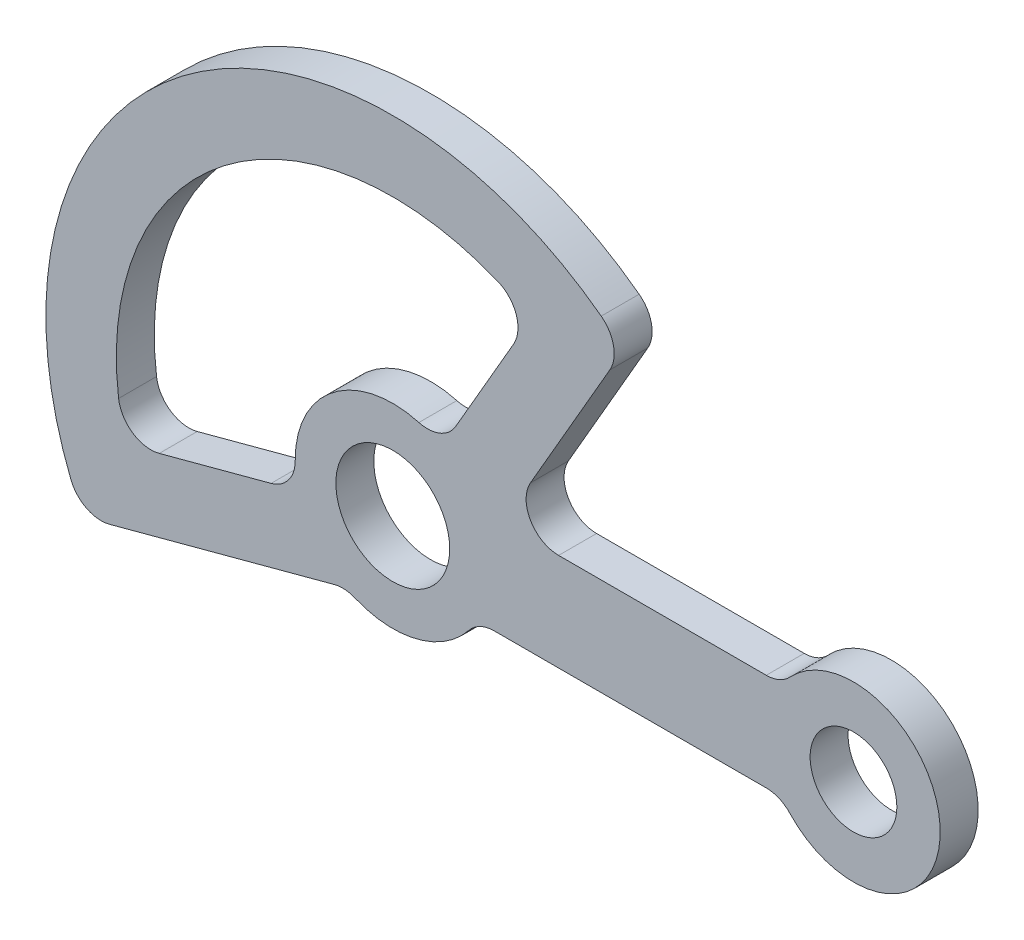
ISO-10303-21;
HEADER;
FILE_DESCRIPTION(('STEP AP214'),'2;1');
FILE_NAME('part.step','',(''),(''),'','','');
FILE_SCHEMA(('AUTOMOTIVE_DESIGN { 1 0 10303 214 1 1 1 1 }'));
ENDSEC;
DATA;
#1=APPLICATION_CONTEXT('core data for automotive mechanical design processes');
#2=APPLICATION_PROTOCOL_DEFINITION('international standard','automotive_design',2000,#1);
#3=PRODUCT_CONTEXT('',#1,'mechanical');
#4=PRODUCT('Part','Part','',(#3));
#5=PRODUCT_RELATED_PRODUCT_CATEGORY('part','',(#4));
#6=PRODUCT_DEFINITION_FORMATION('','',#4);
#7=PRODUCT_DEFINITION_CONTEXT('part definition',#1,'design');
#8=PRODUCT_DEFINITION('design','',#6,#7);
#9=PRODUCT_DEFINITION_SHAPE('','',#8);
#10=(LENGTH_UNIT() NAMED_UNIT(*) SI_UNIT(.MILLI.,.METRE.));
#11=(NAMED_UNIT(*) PLANE_ANGLE_UNIT() SI_UNIT($,.RADIAN.));
#12=(NAMED_UNIT(*) SI_UNIT($,.STERADIAN.) SOLID_ANGLE_UNIT());
#13=UNCERTAINTY_MEASURE_WITH_UNIT(LENGTH_MEASURE(1.E-05),#10,'distance_accuracy_value','');
#14=(GEOMETRIC_REPRESENTATION_CONTEXT(3) GLOBAL_UNCERTAINTY_ASSIGNED_CONTEXT((#13)) GLOBAL_UNIT_ASSIGNED_CONTEXT((#10,
#11,#12)) REPRESENTATION_CONTEXT('',''));
#15=CARTESIAN_POINT('',(0.,0.,0.));
#16=DIRECTION('',(0.,0.,1.));
#17=DIRECTION('',(1.,0.,0.));
#18=AXIS2_PLACEMENT_3D('',#15,#16,#17);
#19=CARTESIAN_POINT('',(85.,0.,7.));
#20=DIRECTION('',(0.,0.,1.));
#21=DIRECTION('',(1.,0.,0.));
#22=AXIS2_PLACEMENT_3D('',#19,#20,#21);
#23=PLANE('',#22);
#24=CARTESIAN_POINT('',(0.,0.,7.));
#25=DIRECTION('',(0.,0.,1.));
#26=DIRECTION('',(1.,0.,0.));
#27=AXIS2_PLACEMENT_3D('',#24,#25,#26);
#28=CIRCLE('',#27,10.5);
#29=CARTESIAN_POINT('',(10.5,0.,7.));
#30=VERTEX_POINT('',#29);
#31=EDGE_CURVE('E227',#30,#30,#28,.T.);
#32=ORIENTED_EDGE('',*,*,#31,.F.);
#33=EDGE_LOOP('',(#32));
#34=FACE_BOUND('',#33,.T.);
#35=CARTESIAN_POINT('',(0.,0.,7.));
#36=DIRECTION('',(0.,0.,1.));
#37=DIRECTION('',(1.,0.,0.));
#38=AXIS2_PLACEMENT_3D('',#35,#36,#37);
#39=CIRCLE('',#38,64.);
#40=CARTESIAN_POINT('',(38.4553888744394,51.1584114932788,7.));
#41=VERTEX_POINT('',#40);
#42=CARTESIAN_POINT('',(-59.3682179208102,-23.9042820621576,7.));
#43=VERTEX_POINT('',#42);
#44=EDGE_CURVE('E445',#41,#43,#39,.T.);
#45=ORIENTED_EDGE('',*,*,#44,.T.);
#46=CARTESIAN_POINT('',(-53.8024474907343,-21.6632556188303,7.));
#47=DIRECTION('',(0.,0.,1.));
#48=DIRECTION('',(1.,0.,0.));
#49=AXIS2_PLACEMENT_3D('',#46,#47,#48);
#50=CIRCLE('',#49,6.);
#51=CARTESIAN_POINT('',(-52.2495332201192,-27.4588105765648,7.));
#52=VERTEX_POINT('',#51);
#53=EDGE_CURVE('E296',#43,#52,#50,.T.);
#54=ORIENTED_EDGE('',*,*,#53,.T.);
#55=DIRECTION('',(0.96592582628907,0.258819045102515,0.));
#56=VECTOR('',#55,1.);
#57=CARTESIAN_POINT('',(-57.16584787117,-28.7761331170511,7.));
#58=LINE('',#57,#56);
#59=CARTESIAN_POINT('',(-10.7986052500332,-16.3520679014599,7.));
#60=VERTEX_POINT('',#59);
#61=EDGE_CURVE('E449',#52,#60,#58,.T.);
#62=ORIENTED_EDGE('',*,*,#61,.T.);
#63=CARTESIAN_POINT('',(-9.24569097941816,-22.1476228591943,7.));
#64=DIRECTION('',(0.,0.,1.));
#65=DIRECTION('',(1.,0.,0.));
#66=AXIS2_PLACEMENT_3D('',#63,#64,#65);
#67=CIRCLE('',#66,6.);
#68=CARTESIAN_POINT('',(-6.93426823456362,-16.6107171443957,7.));
#69=VERTEX_POINT('',#68);
#70=EDGE_CURVE('E323',#60,#69,#67,.F.);
#71=ORIENTED_EDGE('',*,*,#70,.T.);
#72=CARTESIAN_POINT('',(0.,0.,7.));
#73=DIRECTION('',(0.,0.,1.));
#74=DIRECTION('',(1.,0.,0.));
#75=AXIS2_PLACEMENT_3D('',#72,#73,#74);
#76=CIRCLE('',#75,18.);
#77=CARTESIAN_POINT('',(14.0512454963964,-11.25,7.));
#78=VERTEX_POINT('',#77);
#79=EDGE_CURVE('E452',#69,#78,#76,.T.);
#80=ORIENTED_EDGE('',*,*,#79,.T.);
#81=CARTESIAN_POINT('',(18.7349939951952,-15.,7.));
#82=DIRECTION('',(0.,0.,1.));
#83=DIRECTION('',(1.,0.,0.));
#84=AXIS2_PLACEMENT_3D('',#81,#82,#83);
#85=CIRCLE('',#84,6.);
#86=CARTESIAN_POINT('',(18.7349939951952,-8.99999999999999,7.));
#87=VERTEX_POINT('',#86);
#88=EDGE_CURVE('E317',#78,#87,#85,.F.);
#89=ORIENTED_EDGE('',*,*,#88,.T.);
#90=DIRECTION('',(1.,0.,0.));
#91=VECTOR('',#90,1.);
#92=CARTESIAN_POINT('',(71.7712434446771,-9.,7.));
#93=LINE('',#92,#91);
#94=CARTESIAN_POINT('',(68.9065230605689,-9.,7.));
#95=VERTEX_POINT('',#94);
#96=EDGE_CURVE('E238',#87,#95,#93,.T.);
#97=ORIENTED_EDGE('',*,*,#96,.T.);
#98=CARTESIAN_POINT('',(68.9065230605689,-15.,7.));
#99=DIRECTION('',(0.,0.,1.));
#100=DIRECTION('',(1.,0.,0.));
#101=AXIS2_PLACEMENT_3D('',#98,#99,#100);
#102=CIRCLE('',#101,6.);
#103=CARTESIAN_POINT('',(73.2956531349592,-10.9090909090909,7.));
#104=VERTEX_POINT('',#103);
#105=EDGE_CURVE('E205',#95,#104,#102,.F.);
#106=ORIENTED_EDGE('',*,*,#105,.T.);
#107=CARTESIAN_POINT('',(85.,0.,7.));
#108=DIRECTION('',(0.,0.,1.));
#109=DIRECTION('',(1.,0.,0.));
#110=AXIS2_PLACEMENT_3D('',#107,#108,#109);
#111=CIRCLE('',#110,16.);
#112=CARTESIAN_POINT('',(73.2956531349592,10.9090909090909,7.));
#113=VERTEX_POINT('',#112);
#114=EDGE_CURVE('E215',#104,#113,#111,.T.);
#115=ORIENTED_EDGE('',*,*,#114,.T.);
#116=CARTESIAN_POINT('',(68.9065230605689,15.,7.));
#117=DIRECTION('',(0.,0.,1.));
#118=DIRECTION('',(1.,0.,0.));
#119=AXIS2_PLACEMENT_3D('',#116,#117,#118);
#120=CIRCLE('',#119,6.);
#121=CARTESIAN_POINT('',(68.9065230605689,9.,7.));
#122=VERTEX_POINT('',#121);
#123=EDGE_CURVE('E328',#113,#122,#120,.F.);
#124=ORIENTED_EDGE('',*,*,#123,.T.);
#125=DIRECTION('',(-1.,0.,0.));
#126=VECTOR('',#125,1.);
#127=CARTESIAN_POINT('',(71.7712434446771,9.,7.));
#128=LINE('',#127,#126);
#129=CARTESIAN_POINT('',(30.5995642670502,8.99999999999999,7.));
#130=VERTEX_POINT('',#129);
#131=EDGE_CURVE('E437',#122,#130,#128,.T.);
#132=ORIENTED_EDGE('',*,*,#131,.T.);
#133=CARTESIAN_POINT('',(30.5995642670502,15.,7.));
#134=DIRECTION('',(0.,0.,1.));
#135=DIRECTION('',(1.,0.,0.));
#136=AXIS2_PLACEMENT_3D('',#133,#134,#135);
#137=CIRCLE('',#136,6.);
#138=CARTESIAN_POINT('',(25.4034118443436,18.,7.));
#139=VERTEX_POINT('',#138);
#140=EDGE_CURVE('E334',#130,#139,#137,.F.);
#141=ORIENTED_EDGE('',*,*,#140,.T.);
#142=DIRECTION('',(0.500000000000001,0.866025403784438,0.));
#143=VECTOR('',#142,1.);
#144=CARTESIAN_POINT('',(42.5912203169844,47.7701575453766,7.));
#145=LINE('',#144,#143);
#146=CARTESIAN_POINT('',(40.0463485901673,43.3623104157839,7.));
#147=VERTEX_POINT('',#146);
#148=EDGE_CURVE('E441',#139,#147,#145,.T.);
#149=ORIENTED_EDGE('',*,*,#148,.T.);
#150=CARTESIAN_POINT('',(34.8501961674607,46.3623104157839,7.));
#151=DIRECTION('',(0.,0.,1.));
#152=DIRECTION('',(1.,0.,0.));
#153=AXIS2_PLACEMENT_3D('',#150,#151,#152);
#154=CIRCLE('',#153,6.);
#155=EDGE_CURVE('E293',#147,#41,#154,.T.);
#156=ORIENTED_EDGE('',*,*,#155,.T.);
#157=EDGE_LOOP('',(#45,#54,#62,#71,#80,#89,#97,#106,#115,#124,#132,#141,#149,#156));
#158=FACE_BOUND('',#157,.T.);
#159=CARTESIAN_POINT('',(85.,0.,7.));
#160=DIRECTION('',(0.,0.,1.));
#161=DIRECTION('',(1.,0.,0.));
#162=AXIS2_PLACEMENT_3D('',#159,#160,#161);
#163=CIRCLE('',#162,8.00000000000001);
#164=CARTESIAN_POINT('',(93.,0.,7.));
#165=VERTEX_POINT('',#164);
#166=EDGE_CURVE('E425',#165,#165,#163,.T.);
#167=ORIENTED_EDGE('',*,*,#166,.F.);
#168=EDGE_LOOP('',(#167));
#169=FACE_BOUND('',#168,.T.);
#170=DIRECTION('',(0.96592582628907,0.258819045102515,0.));
#171=VECTOR('',#170,1.);
#172=CARTESIAN_POINT('',(-17.3866648732033,-4.65874281184526,7.));
#173=LINE('',#172,#171);
#174=CARTESIAN_POINT('',(-43.0785592152712,-11.5428651528279,7.));
#175=VERTEX_POINT('',#174);
#176=CARTESIAN_POINT('',(-22.4460878333352,-6.01441110818007,7.));
#177=VERTEX_POINT('',#176);
#178=EDGE_CURVE('E399',#175,#177,#173,.T.);
#179=ORIENTED_EDGE('',*,*,#178,.F.);
#180=CARTESIAN_POINT('',(-44.6314734858863,-5.74731019509351,7.));
#181=DIRECTION('',(0.,0.,1.));
#182=DIRECTION('',(1.,0.,0.));
#183=AXIS2_PLACEMENT_3D('',#180,#181,#182);
#184=CIRCLE('',#183,6.);
#185=CARTESIAN_POINT('',(-50.5823366173378,-6.51361822110598,7.));
#186=VERTEX_POINT('',#185);
#187=EDGE_CURVE('E11',#175,#186,#184,.F.);
#188=ORIENTED_EDGE('',*,*,#187,.T.);
#189=CARTESIAN_POINT('',(0.,0.,7.));
#190=DIRECTION('',(0.,0.,1.));
#191=DIRECTION('',(1.,0.,0.));
#192=AXIS2_PLACEMENT_3D('',#189,#190,#191);
#193=CIRCLE('',#192,51.);
#194=CARTESIAN_POINT('',(19.3833441247073,47.1729368445847,7.));
#195=VERTEX_POINT('',#194);
#196=EDGE_CURVE('E397',#195,#186,#193,.T.);
#197=ORIENTED_EDGE('',*,*,#196,.F.);
#198=CARTESIAN_POINT('',(17.1029506982712,41.6231795687512,7.));
#199=DIRECTION('',(0.,0.,1.));
#200=DIRECTION('',(1.,0.,0.));
#201=AXIS2_PLACEMENT_3D('',#198,#199,#200);
#202=CIRCLE('',#201,6.);
#203=CARTESIAN_POINT('',(22.2991031209778,38.6231795687512,7.));
#204=VERTEX_POINT('',#203);
#205=EDGE_CURVE('E373',#195,#204,#202,.F.);
#206=ORIENTED_EDGE('',*,*,#205,.T.);
#207=DIRECTION('',(0.500000000000001,0.866025403784438,0.));
#208=VECTOR('',#207,1.);
#209=CARTESIAN_POINT('',(9.00000000000003,15.5884572681199,7.));
#210=LINE('',#209,#208);
#211=CARTESIAN_POINT('',(11.6189500386223,20.1246117974981,7.));
#212=VERTEX_POINT('',#211);
#213=EDGE_CURVE('E415',#212,#204,#210,.T.);
#214=ORIENTED_EDGE('',*,*,#213,.F.);
#215=CARTESIAN_POINT('',(6.42279761591566,23.1246117974981,7.));
#216=DIRECTION('',(0.,0.,1.));
#217=DIRECTION('',(1.,0.,0.));
#218=AXIS2_PLACEMENT_3D('',#215,#216,#217);
#219=CIRCLE('',#218,6.);
#220=CARTESIAN_POINT('',(4.81709821193674,17.3434588481236,7.));
#221=VERTEX_POINT('',#220);
#222=EDGE_CURVE('E367',#212,#221,#219,.F.);
#223=ORIENTED_EDGE('',*,*,#222,.T.);
#224=CARTESIAN_POINT('',(0.,0.,7.));
#225=DIRECTION('',(0.,0.,-1.));
#226=DIRECTION('',(1.,0.,0.));
#227=AXIS2_PLACEMENT_3D('',#224,#225,#226);
#228=CIRCLE('',#227,18.);
#229=CARTESIAN_POINT('',(-17.9992515779627,-0.164142112834241,7.));
#230=VERTEX_POINT('',#229);
#231=EDGE_CURVE('E408',#230,#221,#228,.T.);
#232=ORIENTED_EDGE('',*,*,#231,.F.);
#233=CARTESIAN_POINT('',(-23.9990021039503,-0.218856150445655,7.));
#234=DIRECTION('',(0.,0.,1.));
#235=DIRECTION('',(1.,0.,0.));
#236=AXIS2_PLACEMENT_3D('',#233,#234,#235);
#237=CIRCLE('',#236,6.);
#238=EDGE_CURVE('E59',#230,#177,#237,.F.);
#239=ORIENTED_EDGE('',*,*,#238,.T.);
#240=EDGE_LOOP('',(#179,#188,#197,#206,#214,#223,#232,#239));
#241=FACE_BOUND('',#240,.T.);
#242=ADVANCED_FACE('F43',(#34,#158,#169,#241),#23,.T.);
#243=CARTESIAN_POINT('',(85.,0.,0.));
#244=DIRECTION('',(0.,0.,1.));
#245=DIRECTION('',(1.,0.,0.));
#246=AXIS2_PLACEMENT_3D('',#243,#244,#245);
#247=PLANE('',#246);
#248=CARTESIAN_POINT('',(85.,0.,0.));
#249=DIRECTION('',(0.,0.,1.));
#250=DIRECTION('',(1.,0.,0.));
#251=AXIS2_PLACEMENT_3D('',#248,#249,#250);
#252=CIRCLE('',#251,8.00000000000001);
#253=CARTESIAN_POINT('',(93.,0.,0.));
#254=VERTEX_POINT('',#253);
#255=EDGE_CURVE('E419',#254,#254,#252,.T.);
#256=ORIENTED_EDGE('',*,*,#255,.T.);
#257=EDGE_LOOP('',(#256));
#258=FACE_BOUND('',#257,.T.);
#259=CARTESIAN_POINT('',(0.,0.,0.));
#260=DIRECTION('',(0.,0.,1.));
#261=DIRECTION('',(1.,0.,0.));
#262=AXIS2_PLACEMENT_3D('',#259,#260,#261);
#263=CIRCLE('',#262,10.5);
#264=CARTESIAN_POINT('',(10.5,0.,0.));
#265=VERTEX_POINT('',#264);
#266=EDGE_CURVE('E235',#265,#265,#263,.T.);
#267=ORIENTED_EDGE('',*,*,#266,.T.);
#268=EDGE_LOOP('',(#267));
#269=FACE_BOUND('',#268,.T.);
#270=DIRECTION('',(0.96592582628907,0.258819045102515,0.));
#271=VECTOR('',#270,1.);
#272=CARTESIAN_POINT('',(-57.16584787117,-28.7761331170511,0.));
#273=LINE('',#272,#271);
#274=CARTESIAN_POINT('',(-52.2495332201192,-27.4588105765648,0.));
#275=VERTEX_POINT('',#274);
#276=CARTESIAN_POINT('',(-10.7986052500332,-16.3520679014599,0.));
#277=VERTEX_POINT('',#276);
#278=EDGE_CURVE('E248',#275,#277,#273,.T.);
#279=ORIENTED_EDGE('',*,*,#278,.F.);
#280=CARTESIAN_POINT('',(-53.8024474907343,-21.6632556188303,0.));
#281=DIRECTION('',(0.,0.,1.));
#282=DIRECTION('',(1.,0.,0.));
#283=AXIS2_PLACEMENT_3D('',#280,#281,#282);
#284=CIRCLE('',#283,6.);
#285=CARTESIAN_POINT('',(-59.3682179208102,-23.9042820621576,0.));
#286=VERTEX_POINT('',#285);
#287=EDGE_CURVE('E283',#275,#286,#284,.F.);
#288=ORIENTED_EDGE('',*,*,#287,.T.);
#289=CARTESIAN_POINT('',(0.,0.,0.));
#290=DIRECTION('',(0.,0.,1.));
#291=DIRECTION('',(1.,0.,0.));
#292=AXIS2_PLACEMENT_3D('',#289,#290,#291);
#293=CIRCLE('',#292,64.);
#294=CARTESIAN_POINT('',(38.4553888744394,51.1584114932788,0.));
#295=VERTEX_POINT('',#294);
#296=EDGE_CURVE('E244',#295,#286,#293,.T.);
#297=ORIENTED_EDGE('',*,*,#296,.F.);
#298=CARTESIAN_POINT('',(34.8501961674607,46.3623104157839,0.));
#299=DIRECTION('',(0.,0.,1.));
#300=DIRECTION('',(1.,0.,0.));
#301=AXIS2_PLACEMENT_3D('',#298,#299,#300);
#302=CIRCLE('',#301,6.);
#303=CARTESIAN_POINT('',(40.0463485901673,43.3623104157839,0.));
#304=VERTEX_POINT('',#303);
#305=EDGE_CURVE('E280',#295,#304,#302,.F.);
#306=ORIENTED_EDGE('',*,*,#305,.T.);
#307=DIRECTION('',(0.500000000000001,0.866025403784438,0.));
#308=VECTOR('',#307,1.);
#309=CARTESIAN_POINT('',(42.5912203169844,47.7701575453766,0.));
#310=LINE('',#309,#308);
#311=CARTESIAN_POINT('',(25.4034118443436,18.,0.));
#312=VERTEX_POINT('',#311);
#313=EDGE_CURVE('E232',#312,#304,#310,.T.);
#314=ORIENTED_EDGE('',*,*,#313,.F.);
#315=CARTESIAN_POINT('',(30.5995642670502,15.,0.));
#316=DIRECTION('',(0.,0.,1.));
#317=DIRECTION('',(1.,0.,0.));
#318=AXIS2_PLACEMENT_3D('',#315,#316,#317);
#319=CIRCLE('',#318,6.);
#320=CARTESIAN_POINT('',(30.5995642670502,8.99999999999999,0.));
#321=VERTEX_POINT('',#320);
#322=EDGE_CURVE('E331',#312,#321,#319,.T.);
#323=ORIENTED_EDGE('',*,*,#322,.T.);
#324=DIRECTION('',(-1.,0.,0.));
#325=VECTOR('',#324,1.);
#326=CARTESIAN_POINT('',(71.7712434446771,9.,0.));
#327=LINE('',#326,#325);
#328=CARTESIAN_POINT('',(68.9065230605689,9.,0.));
#329=VERTEX_POINT('',#328);
#330=EDGE_CURVE('E226',#329,#321,#327,.T.);
#331=ORIENTED_EDGE('',*,*,#330,.F.);
#332=CARTESIAN_POINT('',(68.9065230605689,15.,0.));
#333=DIRECTION('',(0.,0.,1.));
#334=DIRECTION('',(1.,0.,0.));
#335=AXIS2_PLACEMENT_3D('',#332,#333,#334);
#336=CIRCLE('',#335,6.);
#337=CARTESIAN_POINT('',(73.2956531349592,10.9090909090909,0.));
#338=VERTEX_POINT('',#337);
#339=EDGE_CURVE('E224',#329,#338,#336,.T.);
#340=ORIENTED_EDGE('',*,*,#339,.T.);
#341=CARTESIAN_POINT('',(85.,0.,0.));
#342=DIRECTION('',(0.,0.,1.));
#343=DIRECTION('',(1.,0.,0.));
#344=AXIS2_PLACEMENT_3D('',#341,#342,#343);
#345=CIRCLE('',#344,16.);
#346=CARTESIAN_POINT('',(73.2956531349592,-10.9090909090909,0.));
#347=VERTEX_POINT('',#346);
#348=EDGE_CURVE('E212',#347,#338,#345,.T.);
#349=ORIENTED_EDGE('',*,*,#348,.F.);
#350=CARTESIAN_POINT('',(68.9065230605689,-15.,0.));
#351=DIRECTION('',(0.,0.,1.));
#352=DIRECTION('',(1.,0.,0.));
#353=AXIS2_PLACEMENT_3D('',#350,#351,#352);
#354=CIRCLE('',#353,6.);
#355=CARTESIAN_POINT('',(68.9065230605689,-9.,0.));
#356=VERTEX_POINT('',#355);
#357=EDGE_CURVE('E194',#347,#356,#354,.T.);
#358=ORIENTED_EDGE('',*,*,#357,.T.);
#359=DIRECTION('',(1.,0.,0.));
#360=VECTOR('',#359,1.);
#361=CARTESIAN_POINT('',(71.7712434446771,-9.,0.));
#362=LINE('',#361,#360);
#363=CARTESIAN_POINT('',(18.7349939951952,-8.99999999999999,0.));
#364=VERTEX_POINT('',#363);
#365=EDGE_CURVE('E256',#364,#356,#362,.T.);
#366=ORIENTED_EDGE('',*,*,#365,.F.);
#367=CARTESIAN_POINT('',(18.7349939951952,-15.,0.));
#368=DIRECTION('',(0.,0.,1.));
#369=DIRECTION('',(1.,0.,0.));
#370=AXIS2_PLACEMENT_3D('',#367,#368,#369);
#371=CIRCLE('',#370,6.);
#372=CARTESIAN_POINT('',(14.0512454963964,-11.25,0.));
#373=VERTEX_POINT('',#372);
#374=EDGE_CURVE('E314',#364,#373,#371,.T.);
#375=ORIENTED_EDGE('',*,*,#374,.T.);
#376=CARTESIAN_POINT('',(0.,0.,0.));
#377=DIRECTION('',(0.,0.,1.));
#378=DIRECTION('',(1.,0.,0.));
#379=AXIS2_PLACEMENT_3D('',#376,#377,#378);
#380=CIRCLE('',#379,18.);
#381=CARTESIAN_POINT('',(-6.93426823456362,-16.6107171443957,0.));
#382=VERTEX_POINT('',#381);
#383=EDGE_CURVE('E252',#382,#373,#380,.T.);
#384=ORIENTED_EDGE('',*,*,#383,.F.);
#385=CARTESIAN_POINT('',(-9.24569097941816,-22.1476228591943,0.));
#386=DIRECTION('',(0.,0.,1.));
#387=DIRECTION('',(1.,0.,0.));
#388=AXIS2_PLACEMENT_3D('',#385,#386,#387);
#389=CIRCLE('',#388,6.);
#390=EDGE_CURVE('E320',#382,#277,#389,.T.);
#391=ORIENTED_EDGE('',*,*,#390,.T.);
#392=EDGE_LOOP('',(#279,#288,#297,#306,#314,#323,#331,#340,#349,#358,#366,#375,#384,#391));
#393=FACE_BOUND('',#392,.T.);
#394=DIRECTION('',(0.500000000000001,0.866025403784438,0.));
#395=VECTOR('',#394,1.);
#396=CARTESIAN_POINT('',(9.00000000000003,15.5884572681199,0.));
#397=LINE('',#396,#395);
#398=CARTESIAN_POINT('',(11.6189500386223,20.1246117974981,0.));
#399=VERTEX_POINT('',#398);
#400=CARTESIAN_POINT('',(22.2991031209778,38.6231795687512,0.));
#401=VERTEX_POINT('',#400);
#402=EDGE_CURVE('E404',#399,#401,#397,.T.);
#403=ORIENTED_EDGE('',*,*,#402,.T.);
#404=CARTESIAN_POINT('',(17.1029506982712,41.6231795687512,0.));
#405=DIRECTION('',(0.,0.,1.));
#406=DIRECTION('',(1.,0.,0.));
#407=AXIS2_PLACEMENT_3D('',#404,#405,#406);
#408=CIRCLE('',#407,6.);
#409=CARTESIAN_POINT('',(19.3833441247073,47.1729368445847,0.));
#410=VERTEX_POINT('',#409);
#411=EDGE_CURVE('E370',#401,#410,#408,.T.);
#412=ORIENTED_EDGE('',*,*,#411,.T.);
#413=CARTESIAN_POINT('',(0.,0.,0.));
#414=DIRECTION('',(0.,0.,1.));
#415=DIRECTION('',(1.,0.,0.));
#416=AXIS2_PLACEMENT_3D('',#413,#414,#415);
#417=CIRCLE('',#416,51.);
#418=CARTESIAN_POINT('',(-50.5823366173378,-6.51361822110598,0.));
#419=VERTEX_POINT('',#418);
#420=EDGE_CURVE('E386',#410,#419,#417,.T.);
#421=ORIENTED_EDGE('',*,*,#420,.T.);
#422=CARTESIAN_POINT('',(-44.6314734858863,-5.74731019509351,0.));
#423=DIRECTION('',(0.,0.,1.));
#424=DIRECTION('',(1.,0.,0.));
#425=AXIS2_PLACEMENT_3D('',#422,#423,#424);
#426=CIRCLE('',#425,6.);
#427=CARTESIAN_POINT('',(-43.0785592152712,-11.5428651528279,0.));
#428=VERTEX_POINT('',#427);
#429=EDGE_CURVE('E52',#419,#428,#426,.T.);
#430=ORIENTED_EDGE('',*,*,#429,.T.);
#431=DIRECTION('',(0.96592582628907,0.258819045102515,0.));
#432=VECTOR('',#431,1.);
#433=CARTESIAN_POINT('',(-17.3866648732033,-4.65874281184526,0.));
#434=LINE('',#433,#432);
#435=CARTESIAN_POINT('',(-22.4460878333352,-6.01441110818007,0.));
#436=VERTEX_POINT('',#435);
#437=EDGE_CURVE('E384',#428,#436,#434,.T.);
#438=ORIENTED_EDGE('',*,*,#437,.T.);
#439=CARTESIAN_POINT('',(-23.9990021039503,-0.218856150445655,0.));
#440=DIRECTION('',(0.,0.,1.));
#441=DIRECTION('',(1.,0.,0.));
#442=AXIS2_PLACEMENT_3D('',#439,#440,#441);
#443=CIRCLE('',#442,6.);
#444=CARTESIAN_POINT('',(-17.9992515779627,-0.164142112834241,0.));
#445=VERTEX_POINT('',#444);
#446=EDGE_CURVE('E376',#436,#445,#443,.T.);
#447=ORIENTED_EDGE('',*,*,#446,.T.);
#448=CARTESIAN_POINT('',(0.,0.,0.));
#449=DIRECTION('',(0.,0.,-1.));
#450=DIRECTION('',(1.,0.,0.));
#451=AXIS2_PLACEMENT_3D('',#448,#449,#450);
#452=CIRCLE('',#451,18.);
#453=CARTESIAN_POINT('',(4.81709821193674,17.3434588481236,0.));
#454=VERTEX_POINT('',#453);
#455=EDGE_CURVE('E392',#445,#454,#452,.T.);
#456=ORIENTED_EDGE('',*,*,#455,.T.);
#457=CARTESIAN_POINT('',(6.42279761591566,23.1246117974981,0.));
#458=DIRECTION('',(0.,0.,1.));
#459=DIRECTION('',(1.,0.,0.));
#460=AXIS2_PLACEMENT_3D('',#457,#458,#459);
#461=CIRCLE('',#460,6.);
#462=EDGE_CURVE('E364',#454,#399,#461,.T.);
#463=ORIENTED_EDGE('',*,*,#462,.T.);
#464=EDGE_LOOP('',(#403,#412,#421,#430,#438,#447,#456,#463));
#465=FACE_BOUND('',#464,.T.);
#466=ADVANCED_FACE('F221',(#258,#269,#393,#465),#247,.F.);
#467=CARTESIAN_POINT('',(85.,0.,7.));
#468=DIRECTION('',(0.,0.,-1.));
#469=DIRECTION('',(-1.,0.,0.));
#470=AXIS2_PLACEMENT_3D('',#467,#468,#469);
#471=CYLINDRICAL_SURFACE('',#470,16.);
#472=ORIENTED_EDGE('',*,*,#114,.F.);
#473=DIRECTION('',(0.,0.,-1.));
#474=VECTOR('',#473,1.);
#475=CARTESIAN_POINT('',(73.2956531349592,-10.9090909090909,7.));
#476=LINE('',#475,#474);
#477=EDGE_CURVE('E198',#104,#347,#476,.T.);
#478=ORIENTED_EDGE('',*,*,#477,.T.);
#479=ORIENTED_EDGE('',*,*,#348,.T.);
#480=DIRECTION('',(0.,0.,-1.));
#481=VECTOR('',#480,1.);
#482=CARTESIAN_POINT('',(73.2956531349592,10.9090909090909,7.));
#483=LINE('',#482,#481);
#484=EDGE_CURVE('E218',#338,#113,#483,.F.);
#485=ORIENTED_EDGE('',*,*,#484,.T.);
#486=EDGE_LOOP('',(#472,#478,#479,#485));
#487=FACE_BOUND('',#486,.T.);
#488=ADVANCED_FACE('F211',(#487),#471,.T.);
#489=CARTESIAN_POINT('',(71.7712434446771,9.,7.));
#490=DIRECTION('',(0.,-1.,0.));
#491=DIRECTION('',(1.,0.,0.));
#492=AXIS2_PLACEMENT_3D('',#489,#490,#491);
#493=PLANE('',#492);
#494=ORIENTED_EDGE('',*,*,#131,.F.);
#495=DIRECTION('',(0.,0.,1.));
#496=VECTOR('',#495,1.);
#497=CARTESIAN_POINT('',(68.9065230605689,9.,0.));
#498=LINE('',#497,#496);
#499=EDGE_CURVE('E302',#122,#329,#498,.F.);
#500=ORIENTED_EDGE('',*,*,#499,.T.);
#501=ORIENTED_EDGE('',*,*,#330,.T.);
#502=DIRECTION('',(0.,0.,-1.));
#503=VECTOR('',#502,1.);
#504=CARTESIAN_POINT('',(30.5995642670502,8.99999999999999,7.));
#505=LINE('',#504,#503);
#506=EDGE_CURVE('E299',#321,#130,#505,.F.);
#507=ORIENTED_EDGE('',*,*,#506,.T.);
#508=EDGE_LOOP('',(#494,#500,#501,#507));
#509=FACE_BOUND('',#508,.T.);
#510=ADVANCED_FACE('F504',(#509),#493,.F.);
#511=CARTESIAN_POINT('',(42.5912203169844,47.7701575453766,7.));
#512=DIRECTION('',(-0.866025403784438,0.500000000000001,0.));
#513=DIRECTION('',(-0.500000000000001,-0.866025403784438,0.));
#514=AXIS2_PLACEMENT_3D('',#511,#512,#513);
#515=PLANE('',#514);
#516=ORIENTED_EDGE('',*,*,#313,.T.);
#517=DIRECTION('',(0.,0.,-1.));
#518=VECTOR('',#517,1.);
#519=CARTESIAN_POINT('',(40.0463485901673,43.3623104157839,7.));
#520=LINE('',#519,#518);
#521=EDGE_CURVE('E206',#304,#147,#520,.F.);
#522=ORIENTED_EDGE('',*,*,#521,.T.);
#523=ORIENTED_EDGE('',*,*,#148,.F.);
#524=DIRECTION('',(0.,0.,-1.));
#525=VECTOR('',#524,1.);
#526=CARTESIAN_POINT('',(25.4034118443436,18.,0.));
#527=LINE('',#526,#525);
#528=EDGE_CURVE('E306',#139,#312,#527,.T.);
#529=ORIENTED_EDGE('',*,*,#528,.T.);
#530=EDGE_LOOP('',(#516,#522,#523,#529));
#531=FACE_BOUND('',#530,.T.);
#532=ADVANCED_FACE('F495',(#531),#515,.F.);
#533=CARTESIAN_POINT('',(0.,0.,7.));
#534=DIRECTION('',(0.,0.,-1.));
#535=DIRECTION('',(-1.,0.,0.));
#536=AXIS2_PLACEMENT_3D('',#533,#534,#535);
#537=CYLINDRICAL_SURFACE('',#536,64.);
#538=ORIENTED_EDGE('',*,*,#296,.T.);
#539=DIRECTION('',(0.,0.,-1.));
#540=VECTOR('',#539,1.);
#541=CARTESIAN_POINT('',(-59.3682179208102,-23.9042820621576,7.));
#542=LINE('',#541,#540);
#543=EDGE_CURVE('E290',#286,#43,#542,.F.);
#544=ORIENTED_EDGE('',*,*,#543,.T.);
#545=ORIENTED_EDGE('',*,*,#44,.F.);
#546=DIRECTION('',(0.,0.,-1.));
#547=VECTOR('',#546,1.);
#548=CARTESIAN_POINT('',(38.4553888744394,51.1584114932788,7.));
#549=LINE('',#548,#547);
#550=EDGE_CURVE('E286',#41,#295,#549,.T.);
#551=ORIENTED_EDGE('',*,*,#550,.T.);
#552=EDGE_LOOP('',(#538,#544,#545,#551));
#553=FACE_BOUND('',#552,.T.);
#554=ADVANCED_FACE('F486',(#553),#537,.T.);
#555=CARTESIAN_POINT('',(-57.16584787117,-28.7761331170511,7.));
#556=DIRECTION('',(-0.258819045102515,0.96592582628907,0.));
#557=DIRECTION('',(-0.96592582628907,-0.258819045102515,0.));
#558=AXIS2_PLACEMENT_3D('',#555,#556,#557);
#559=PLANE('',#558);
#560=ORIENTED_EDGE('',*,*,#278,.T.);
#561=DIRECTION('',(0.,0.,1.));
#562=VECTOR('',#561,1.);
#563=CARTESIAN_POINT('',(-10.7986052500333,-16.3520679014599,7.));
#564=LINE('',#563,#562);
#565=EDGE_CURVE('E277',#277,#60,#564,.T.);
#566=ORIENTED_EDGE('',*,*,#565,.T.);
#567=ORIENTED_EDGE('',*,*,#61,.F.);
#568=DIRECTION('',(0.,0.,-1.));
#569=VECTOR('',#568,1.);
#570=CARTESIAN_POINT('',(-52.2495332201192,-27.4588105765648,7.));
#571=LINE('',#570,#569);
#572=EDGE_CURVE('E273',#52,#275,#571,.T.);
#573=ORIENTED_EDGE('',*,*,#572,.T.);
#574=EDGE_LOOP('',(#560,#566,#567,#573));
#575=FACE_BOUND('',#574,.T.);
#576=ADVANCED_FACE('F477',(#575),#559,.F.);
#577=CARTESIAN_POINT('',(0.,0.,7.));
#578=DIRECTION('',(0.,0.,-1.));
#579=DIRECTION('',(-1.,0.,0.));
#580=AXIS2_PLACEMENT_3D('',#577,#578,#579);
#581=CYLINDRICAL_SURFACE('',#580,18.);
#582=ORIENTED_EDGE('',*,*,#383,.T.);
#583=DIRECTION('',(0.,0.,-1.));
#584=VECTOR('',#583,1.);
#585=CARTESIAN_POINT('',(14.0512454963964,-11.25,7.));
#586=LINE('',#585,#584);
#587=EDGE_CURVE('E270',#373,#78,#586,.F.);
#588=ORIENTED_EDGE('',*,*,#587,.T.);
#589=ORIENTED_EDGE('',*,*,#79,.F.);
#590=DIRECTION('',(0.,0.,-1.));
#591=VECTOR('',#590,1.);
#592=CARTESIAN_POINT('',(-6.93426823456362,-16.6107171443957,7.));
#593=LINE('',#592,#591);
#594=EDGE_CURVE('E266',#69,#382,#593,.T.);
#595=ORIENTED_EDGE('',*,*,#594,.T.);
#596=EDGE_LOOP('',(#582,#588,#589,#595));
#597=FACE_BOUND('',#596,.T.);
#598=ADVANCED_FACE('F470',(#597),#581,.T.);
#599=CARTESIAN_POINT('',(71.7712434446771,-9.,7.));
#600=DIRECTION('',(0.,1.,0.));
#601=DIRECTION('',(-1.,0.,0.));
#602=AXIS2_PLACEMENT_3D('',#599,#600,#601);
#603=PLANE('',#602);
#604=ORIENTED_EDGE('',*,*,#365,.T.);
#605=DIRECTION('',(0.,0.,1.));
#606=VECTOR('',#605,1.);
#607=CARTESIAN_POINT('',(68.9065230605689,-9.,7.));
#608=LINE('',#607,#606);
#609=EDGE_CURVE('E199',#356,#95,#608,.T.);
#610=ORIENTED_EDGE('',*,*,#609,.T.);
#611=ORIENTED_EDGE('',*,*,#96,.F.);
#612=DIRECTION('',(0.,0.,1.));
#613=VECTOR('',#612,1.);
#614=CARTESIAN_POINT('',(18.7349939951952,-8.99999999999999,0.));
#615=LINE('',#614,#613);
#616=EDGE_CURVE('E217',#87,#364,#615,.F.);
#617=ORIENTED_EDGE('',*,*,#616,.T.);
#618=EDGE_LOOP('',(#604,#610,#611,#617));
#619=FACE_BOUND('',#618,.T.);
#620=ADVANCED_FACE('F464',(#619),#603,.F.);
#621=CARTESIAN_POINT('',(0.,0.,7.));
#622=DIRECTION('',(0.,0.,-1.));
#623=DIRECTION('',(-1.,0.,0.));
#624=AXIS2_PLACEMENT_3D('',#621,#622,#623);
#625=CYLINDRICAL_SURFACE('',#624,10.5);
#626=ORIENTED_EDGE('',*,*,#31,.T.);
#627=EDGE_LOOP('',(#626));
#628=FACE_BOUND('',#627,.T.);
#629=ORIENTED_EDGE('',*,*,#266,.F.);
#630=EDGE_LOOP('',(#629));
#631=FACE_BOUND('',#630,.T.);
#632=ADVANCED_FACE('F527',(#628,#631),#625,.F.);
#633=CARTESIAN_POINT('',(85.,0.,7.));
#634=DIRECTION('',(0.,0.,-1.));
#635=DIRECTION('',(-1.,0.,0.));
#636=AXIS2_PLACEMENT_3D('',#633,#634,#635);
#637=CYLINDRICAL_SURFACE('',#636,8.00000000000001);
#638=ORIENTED_EDGE('',*,*,#166,.T.);
#639=EDGE_LOOP('',(#638));
#640=FACE_BOUND('',#639,.T.);
#641=ORIENTED_EDGE('',*,*,#255,.F.);
#642=EDGE_LOOP('',(#641));
#643=FACE_BOUND('',#642,.T.);
#644=ADVANCED_FACE('F605',(#640,#643),#637,.F.);
#645=CARTESIAN_POINT('',(0.,0.,7.));
#646=DIRECTION('',(0.,0.,-1.));
#647=DIRECTION('',(-1.,0.,0.));
#648=AXIS2_PLACEMENT_3D('',#645,#646,#647);
#649=CYLINDRICAL_SURFACE('',#648,51.);
#650=ORIENTED_EDGE('',*,*,#420,.F.);
#651=DIRECTION('',(0.,0.,-1.));
#652=VECTOR('',#651,1.);
#653=CARTESIAN_POINT('',(19.3833441247073,47.1729368445847,7.));
#654=LINE('',#653,#652);
#655=EDGE_CURVE('E355',#410,#195,#654,.F.);
#656=ORIENTED_EDGE('',*,*,#655,.T.);
#657=ORIENTED_EDGE('',*,*,#196,.T.);
#658=DIRECTION('',(0.,0.,-1.));
#659=VECTOR('',#658,1.);
#660=CARTESIAN_POINT('',(-50.5823366173378,-6.51361822110598,7.));
#661=LINE('',#660,#659);
#662=EDGE_CURVE('E351',#186,#419,#661,.T.);
#663=ORIENTED_EDGE('',*,*,#662,.T.);
#664=EDGE_LOOP('',(#650,#656,#657,#663));
#665=FACE_BOUND('',#664,.T.);
#666=ADVANCED_FACE('F401',(#665),#649,.F.);
#667=CARTESIAN_POINT('',(-17.3866648732033,-4.65874281184526,7.));
#668=DIRECTION('',(-0.258819045102515,0.96592582628907,0.));
#669=DIRECTION('',(-0.96592582628907,-0.258819045102515,0.));
#670=AXIS2_PLACEMENT_3D('',#667,#668,#669);
#671=PLANE('',#670);
#672=ORIENTED_EDGE('',*,*,#178,.T.);
#673=DIRECTION('',(0.,0.,1.));
#674=VECTOR('',#673,1.);
#675=CARTESIAN_POINT('',(-22.4460878333352,-6.01441110818007,0.));
#676=LINE('',#675,#674);
#677=EDGE_CURVE('E360',#177,#436,#676,.F.);
#678=ORIENTED_EDGE('',*,*,#677,.T.);
#679=ORIENTED_EDGE('',*,*,#437,.F.);
#680=DIRECTION('',(0.,0.,1.));
#681=VECTOR('',#680,1.);
#682=CARTESIAN_POINT('',(-43.0785592152712,-11.5428651528279,7.));
#683=LINE('',#682,#681);
#684=EDGE_CURVE('E66',#428,#175,#683,.T.);
#685=ORIENTED_EDGE('',*,*,#684,.T.);
#686=EDGE_LOOP('',(#672,#678,#679,#685));
#687=FACE_BOUND('',#686,.T.);
#688=ADVANCED_FACE('F389',(#687),#671,.T.);
#689=CARTESIAN_POINT('',(0.,0.,7.));
#690=DIRECTION('',(0.,0.,-1.));
#691=DIRECTION('',(-1.,0.,0.));
#692=AXIS2_PLACEMENT_3D('',#689,#690,#691);
#693=CYLINDRICAL_SURFACE('',#692,18.);
#694=ORIENTED_EDGE('',*,*,#231,.T.);
#695=DIRECTION('',(0.,0.,-1.));
#696=VECTOR('',#695,1.);
#697=CARTESIAN_POINT('',(4.81709821193674,17.3434588481236,7.));
#698=LINE('',#697,#696);
#699=EDGE_CURVE('E340',#221,#454,#698,.T.);
#700=ORIENTED_EDGE('',*,*,#699,.T.);
#701=ORIENTED_EDGE('',*,*,#455,.F.);
#702=DIRECTION('',(0.,0.,-1.));
#703=VECTOR('',#702,1.);
#704=CARTESIAN_POINT('',(-17.9992515779627,-0.164142112834241,7.));
#705=LINE('',#704,#703);
#706=EDGE_CURVE('E337',#445,#230,#705,.F.);
#707=ORIENTED_EDGE('',*,*,#706,.T.);
#708=EDGE_LOOP('',(#694,#700,#701,#707));
#709=FACE_BOUND('',#708,.T.);
#710=ADVANCED_FACE('F617',(#709),#693,.T.);
#711=CARTESIAN_POINT('',(9.00000000000003,15.5884572681199,7.));
#712=DIRECTION('',(-0.866025403784438,0.500000000000001,0.));
#713=DIRECTION('',(-0.500000000000001,-0.866025403784438,0.));
#714=AXIS2_PLACEMENT_3D('',#711,#712,#713);
#715=PLANE('',#714);
#716=ORIENTED_EDGE('',*,*,#402,.F.);
#717=DIRECTION('',(0.,0.,1.));
#718=VECTOR('',#717,1.);
#719=CARTESIAN_POINT('',(11.6189500386223,20.1246117974981,7.));
#720=LINE('',#719,#718);
#721=EDGE_CURVE('E348',#399,#212,#720,.T.);
#722=ORIENTED_EDGE('',*,*,#721,.T.);
#723=ORIENTED_EDGE('',*,*,#213,.T.);
#724=DIRECTION('',(0.,0.,1.));
#725=VECTOR('',#724,1.);
#726=CARTESIAN_POINT('',(22.2991031209778,38.6231795687512,0.));
#727=LINE('',#726,#725);
#728=EDGE_CURVE('E344',#204,#401,#727,.F.);
#729=ORIENTED_EDGE('',*,*,#728,.T.);
#730=EDGE_LOOP('',(#716,#722,#723,#729));
#731=FACE_BOUND('',#730,.T.);
#732=ADVANCED_FACE('F546',(#731),#715,.T.);
#733=CARTESIAN_POINT('',(68.9065230605689,-15.,7.));
#734=DIRECTION('',(0.,0.,-1.));
#735=DIRECTION('',(-1.,0.,0.));
#736=AXIS2_PLACEMENT_3D('',#733,#734,#735);
#737=CYLINDRICAL_SURFACE('',#736,6.);
#738=ORIENTED_EDGE('',*,*,#105,.F.);
#739=ORIENTED_EDGE('',*,*,#609,.F.);
#740=ORIENTED_EDGE('',*,*,#357,.F.);
#741=ORIENTED_EDGE('',*,*,#477,.F.);
#742=EDGE_LOOP('',(#738,#739,#740,#741));
#743=FACE_BOUND('',#742,.T.);
#744=ADVANCED_FACE('F197',(#743),#737,.F.);
#745=CARTESIAN_POINT('',(18.7349939951952,-15.,7.));
#746=DIRECTION('',(0.,0.,-1.));
#747=DIRECTION('',(-1.,0.,0.));
#748=AXIS2_PLACEMENT_3D('',#745,#746,#747);
#749=CYLINDRICAL_SURFACE('',#748,6.);
#750=ORIENTED_EDGE('',*,*,#88,.F.);
#751=ORIENTED_EDGE('',*,*,#587,.F.);
#752=ORIENTED_EDGE('',*,*,#374,.F.);
#753=ORIENTED_EDGE('',*,*,#616,.F.);
#754=EDGE_LOOP('',(#750,#751,#752,#753));
#755=FACE_BOUND('',#754,.T.);
#756=ADVANCED_FACE('F466',(#755),#749,.F.);
#757=CARTESIAN_POINT('',(-9.24569097941816,-22.1476228591943,7.));
#758=DIRECTION('',(0.,0.,-1.));
#759=DIRECTION('',(-1.,0.,0.));
#760=AXIS2_PLACEMENT_3D('',#757,#758,#759);
#761=CYLINDRICAL_SURFACE('',#760,6.);
#762=ORIENTED_EDGE('',*,*,#70,.F.);
#763=ORIENTED_EDGE('',*,*,#565,.F.);
#764=ORIENTED_EDGE('',*,*,#390,.F.);
#765=ORIENTED_EDGE('',*,*,#594,.F.);
#766=EDGE_LOOP('',(#762,#763,#764,#765));
#767=FACE_BOUND('',#766,.T.);
#768=ADVANCED_FACE('F474',(#767),#761,.F.);
#769=CARTESIAN_POINT('',(-53.8024474907343,-21.6632556188303,7.));
#770=DIRECTION('',(0.,0.,-1.));
#771=DIRECTION('',(-1.,0.,0.));
#772=AXIS2_PLACEMENT_3D('',#769,#770,#771);
#773=CYLINDRICAL_SURFACE('',#772,6.);
#774=ORIENTED_EDGE('',*,*,#53,.F.);
#775=ORIENTED_EDGE('',*,*,#543,.F.);
#776=ORIENTED_EDGE('',*,*,#287,.F.);
#777=ORIENTED_EDGE('',*,*,#572,.F.);
#778=EDGE_LOOP('',(#774,#775,#776,#777));
#779=FACE_BOUND('',#778,.T.);
#780=ADVANCED_FACE('F482',(#779),#773,.T.);
#781=CARTESIAN_POINT('',(68.9065230605689,15.,7.));
#782=DIRECTION('',(0.,0.,-1.));
#783=DIRECTION('',(-1.,0.,0.));
#784=AXIS2_PLACEMENT_3D('',#781,#782,#783);
#785=CYLINDRICAL_SURFACE('',#784,6.);
#786=ORIENTED_EDGE('',*,*,#123,.F.);
#787=ORIENTED_EDGE('',*,*,#484,.F.);
#788=ORIENTED_EDGE('',*,*,#339,.F.);
#789=ORIENTED_EDGE('',*,*,#499,.F.);
#790=EDGE_LOOP('',(#786,#787,#788,#789));
#791=FACE_BOUND('',#790,.T.);
#792=ADVANCED_FACE('F508',(#791),#785,.F.);
#793=CARTESIAN_POINT('',(34.8501961674607,46.3623104157839,7.));
#794=DIRECTION('',(0.,0.,-1.));
#795=DIRECTION('',(-1.,0.,0.));
#796=AXIS2_PLACEMENT_3D('',#793,#794,#795);
#797=CYLINDRICAL_SURFACE('',#796,6.);
#798=ORIENTED_EDGE('',*,*,#155,.F.);
#799=ORIENTED_EDGE('',*,*,#521,.F.);
#800=ORIENTED_EDGE('',*,*,#305,.F.);
#801=ORIENTED_EDGE('',*,*,#550,.F.);
#802=EDGE_LOOP('',(#798,#799,#800,#801));
#803=FACE_BOUND('',#802,.T.);
#804=ADVANCED_FACE('F491',(#803),#797,.T.);
#805=CARTESIAN_POINT('',(30.5995642670502,15.,7.));
#806=DIRECTION('',(0.,0.,1.));
#807=DIRECTION('',(1.,0.,0.));
#808=AXIS2_PLACEMENT_3D('',#805,#806,#807);
#809=CYLINDRICAL_SURFACE('',#808,6.);
#810=ORIENTED_EDGE('',*,*,#140,.F.);
#811=ORIENTED_EDGE('',*,*,#506,.F.);
#812=ORIENTED_EDGE('',*,*,#322,.F.);
#813=ORIENTED_EDGE('',*,*,#528,.F.);
#814=EDGE_LOOP('',(#810,#811,#812,#813));
#815=FACE_BOUND('',#814,.T.);
#816=ADVANCED_FACE('F500',(#815),#809,.F.);
#817=CARTESIAN_POINT('',(6.42279761591566,23.1246117974981,7.));
#818=DIRECTION('',(0.,0.,-1.));
#819=DIRECTION('',(-1.,0.,0.));
#820=AXIS2_PLACEMENT_3D('',#817,#818,#819);
#821=CYLINDRICAL_SURFACE('',#820,6.);
#822=ORIENTED_EDGE('',*,*,#222,.F.);
#823=ORIENTED_EDGE('',*,*,#721,.F.);
#824=ORIENTED_EDGE('',*,*,#462,.F.);
#825=ORIENTED_EDGE('',*,*,#699,.F.);
#826=EDGE_LOOP('',(#822,#823,#824,#825));
#827=FACE_BOUND('',#826,.T.);
#828=ADVANCED_FACE('F579',(#827),#821,.F.);
#829=CARTESIAN_POINT('',(17.1029506982712,41.6231795687512,7.));
#830=DIRECTION('',(0.,0.,-1.));
#831=DIRECTION('',(-1.,0.,0.));
#832=AXIS2_PLACEMENT_3D('',#829,#830,#831);
#833=CYLINDRICAL_SURFACE('',#832,6.);
#834=ORIENTED_EDGE('',*,*,#205,.F.);
#835=ORIENTED_EDGE('',*,*,#655,.F.);
#836=ORIENTED_EDGE('',*,*,#411,.F.);
#837=ORIENTED_EDGE('',*,*,#728,.F.);
#838=EDGE_LOOP('',(#834,#835,#836,#837));
#839=FACE_BOUND('',#838,.T.);
#840=ADVANCED_FACE('F646',(#839),#833,.F.);
#841=CARTESIAN_POINT('',(-23.9990021039503,-0.218856150445655,7.));
#842=DIRECTION('',(0.,0.,-1.));
#843=DIRECTION('',(-1.,0.,0.));
#844=AXIS2_PLACEMENT_3D('',#841,#842,#843);
#845=CYLINDRICAL_SURFACE('',#844,6.);
#846=ORIENTED_EDGE('',*,*,#238,.F.);
#847=ORIENTED_EDGE('',*,*,#706,.F.);
#848=ORIENTED_EDGE('',*,*,#446,.F.);
#849=ORIENTED_EDGE('',*,*,#677,.F.);
#850=EDGE_LOOP('',(#846,#847,#848,#849));
#851=FACE_BOUND('',#850,.T.);
#852=ADVANCED_FACE('F657',(#851),#845,.F.);
#853=CARTESIAN_POINT('',(-44.6314734858863,-5.74731019509351,7.));
#854=DIRECTION('',(0.,0.,-1.));
#855=DIRECTION('',(-1.,0.,0.));
#856=AXIS2_PLACEMENT_3D('',#853,#854,#855);
#857=CYLINDRICAL_SURFACE('',#856,6.);
#858=ORIENTED_EDGE('',*,*,#187,.F.);
#859=ORIENTED_EDGE('',*,*,#684,.F.);
#860=ORIENTED_EDGE('',*,*,#429,.F.);
#861=ORIENTED_EDGE('',*,*,#662,.F.);
#862=EDGE_LOOP('',(#858,#859,#860,#861));
#863=FACE_BOUND('',#862,.T.);
#864=ADVANCED_FACE('F45',(#863),#857,.F.);
#865=CLOSED_SHELL('',(#242,#466,#488,#510,#532,#554,#576,#598,#620,#632,#644,#666,#688,#710,
#732,#744,#756,#768,#780,#792,#804,#816,#828,#840,#852,#864));
#866=MANIFOLD_SOLID_BREP('B2',#865);
#867=ADVANCED_BREP_SHAPE_REPRESENTATION('',(#18,#866),#14);
#868=SHAPE_DEFINITION_REPRESENTATION(#9,#867);
ENDSEC;
END-ISO-10303-21;
